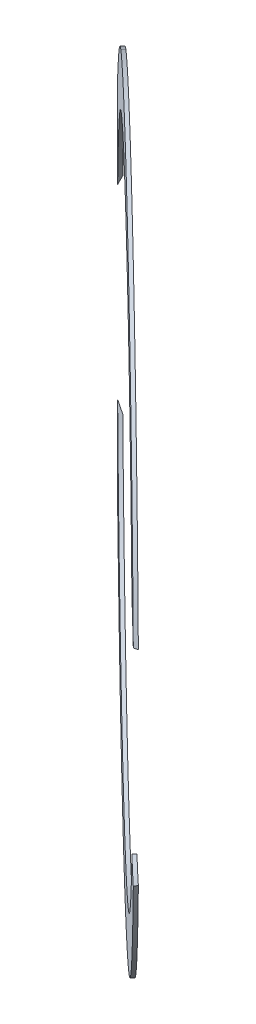
ISO-10303-21;
HEADER;
FILE_DESCRIPTION(('STEP AP214'),'2;1');
FILE_NAME('part.step','',(''),(''),'','','');
FILE_SCHEMA(('AUTOMOTIVE_DESIGN { 1 0 10303 214 1 1 1 1 }'));
ENDSEC;
DATA;
#1=APPLICATION_CONTEXT('core data for automotive mechanical design processes');
#2=APPLICATION_PROTOCOL_DEFINITION('international standard','automotive_design',2000,#1);
#3=PRODUCT_CONTEXT('',#1,'mechanical');
#4=PRODUCT('Part','Part','',(#3));
#5=PRODUCT_RELATED_PRODUCT_CATEGORY('part','',(#4));
#6=PRODUCT_DEFINITION_FORMATION('','',#4);
#7=PRODUCT_DEFINITION_CONTEXT('part definition',#1,'design');
#8=PRODUCT_DEFINITION('design','',#6,#7);
#9=PRODUCT_DEFINITION_SHAPE('','',#8);
#10=(LENGTH_UNIT() NAMED_UNIT(*) SI_UNIT(.MILLI.,.METRE.));
#11=(NAMED_UNIT(*) PLANE_ANGLE_UNIT() SI_UNIT($,.RADIAN.));
#12=(NAMED_UNIT(*) SI_UNIT($,.STERADIAN.) SOLID_ANGLE_UNIT());
#13=UNCERTAINTY_MEASURE_WITH_UNIT(LENGTH_MEASURE(1.E-05),#10,'distance_accuracy_value','');
#14=(GEOMETRIC_REPRESENTATION_CONTEXT(3) GLOBAL_UNCERTAINTY_ASSIGNED_CONTEXT((#13)) GLOBAL_UNIT_ASSIGNED_CONTEXT((#10,
#11,#12)) REPRESENTATION_CONTEXT('',''));
#15=CARTESIAN_POINT('',(0.,0.,0.));
#16=DIRECTION('',(0.,0.,1.));
#17=DIRECTION('',(1.,0.,0.));
#18=AXIS2_PLACEMENT_3D('',#15,#16,#17);
#19=CARTESIAN_POINT('',(-161.990390566707,0.,168.265005002207));
#20=DIRECTION('',(-0.693547097638021,0.,0.720411287639136));
#21=DIRECTION('',(0.720411287639136,0.,0.693547097638021));
#22=AXIS2_PLACEMENT_3D('',#19,#20,#21);
#23=CYLINDRICAL_SURFACE('',#22,298.478991770015);
#24=DIRECTION('',(-0.693547097638021,0.,0.720411287639136));
#25=VECTOR('',#24,1.);
#26=CARTESIAN_POINT('',(-78.6165835414837,265.64566239674,-114.569887943909));
#27=LINE('',#26,#25);
#28=CARTESIAN_POINT('',(-260.035404079115,265.64566239674,73.8760972683337));
#29=VERTEX_POINT('',#28);
#30=CARTESIAN_POINT('',(-262.272648306676,265.64566239674,76.2));
#31=VERTEX_POINT('',#30);
#32=EDGE_CURVE('E96',#29,#31,#27,.T.);
#33=ORIENTED_EDGE('',*,*,#32,.T.);
#34=CARTESIAN_POINT('',(-164.227634794267,0.,170.588907733874));
#35=DIRECTION('',(-0.693547097638021,0.,0.720411287639136));
#36=DIRECTION('',(0.720411287639136,0.,0.693547097638021));
#37=AXIS2_PLACEMENT_3D('',#34,#35,#36);
#38=CIRCLE('',#37,298.478991770015);
#39=CARTESIAN_POINT('',(40.0027643947161,93.3934625162856,367.203540287945));
#40=VERTEX_POINT('',#39);
#41=EDGE_CURVE('E107',#40,#31,#38,.T.);
#42=ORIENTED_EDGE('',*,*,#41,.F.);
#43=CARTESIAN_POINT('',(40.002764394716,93.3934625162856,367.203540287945));
#44=CARTESIAN_POINT('',(40.4197169075131,93.2149037459415,366.855273948581));
#45=CARTESIAN_POINT('',(40.8364476760979,93.0330873220458,366.50848613522));
#46=CARTESIAN_POINT('',(41.6694657248422,92.6629391671512,365.817867560502));
#47=CARTESIAN_POINT('',(42.0857530050017,92.4746074361523,365.474036799145));
#48=CARTESIAN_POINT('',(42.5018185409489,92.2830180516018,365.131684563791));
#49=B_SPLINE_CURVE_WITH_KNOTS('',3,(#43,#44,#45,#46,#47,#48),.UNSPECIFIED.,.F.,.F.,(4,2,4),(0.,
1.71547421922163,3.43094843844166),.UNSPECIFIED.);
#50=CARTESIAN_POINT('',(42.5018185409489,92.2830180516017,365.131684563791));
#51=VERTEX_POINT('',#50);
#52=EDGE_CURVE('E100',#40,#51,#49,.T.);
#53=ORIENTED_EDGE('',*,*,#52,.T.);
#54=CARTESIAN_POINT('',(-161.990390566707,0.,168.265005002207));
#55=DIRECTION('',(-0.693547097638021,0.,0.720411287639136));
#56=DIRECTION('',(0.720411287639136,0.,0.693547097638021));
#57=AXIS2_PLACEMENT_3D('',#54,#55,#56);
#58=CIRCLE('',#57,298.478991770015);
#59=EDGE_CURVE('E109',#51,#29,#58,.T.);
#60=ORIENTED_EDGE('',*,*,#59,.T.);
#61=EDGE_LOOP('',(#33,#42,#53,#60));
#62=FACE_BOUND('',#61,.T.);
#63=ADVANCED_FACE('F41',(#62),#23,.T.);
#64=CARTESIAN_POINT('',(-161.990390566707,0.,168.265005002207));
#65=DIRECTION('',(-0.693547097638021,0.,0.720411287639136));
#66=DIRECTION('',(0.720411287639136,0.,0.693547097638021));
#67=AXIS2_PLACEMENT_3D('',#64,#65,#66);
#68=CYLINDRICAL_SURFACE('',#67,257.203991770015);
#69=CARTESIAN_POINT('',(-164.227634794267,0.,170.588907733874));
#70=DIRECTION('',(-0.693547097638021,0.,0.720411287639136));
#71=DIRECTION('',(0.720411287639136,0.,0.693547097638021));
#72=AXIS2_PLACEMENT_3D('',#69,#70,#71);
#73=CIRCLE('',#72,257.203991770015);
#74=CARTESIAN_POINT('',(6.05168280115659,101.419609224618,334.518497028767));
#75=VERTEX_POINT('',#74);
#76=CARTESIAN_POINT('',(-339.313507627677,84.1866935553801,2.03200000000001));
#77=VERTEX_POINT('',#76);
#78=EDGE_CURVE('E189',#75,#77,#73,.T.);
#79=ORIENTED_EDGE('',*,*,#78,.T.);
#80=CARTESIAN_POINT('',(-1.95622657026756,0.,2.03200000000001));
#81=DIRECTION('',(0.,0.,1.));
#82=DIRECTION('',(-1.,0.,0.));
#83=AXIS2_PLACEMENT_3D('',#80,#81,#82);
#84=ELLIPSE('',#83,357.02382261791,257.203991770015);
#85=CARTESIAN_POINT('',(-334.662345491773,93.2999325440372,2.03200000000001));
#86=VERTEX_POINT('',#85);
#87=EDGE_CURVE('E69',#77,#86,#84,.F.);
#88=ORIENTED_EDGE('',*,*,#87,.T.);
#89=CARTESIAN_POINT('',(-161.990390566707,0.,168.265005002207));
#90=DIRECTION('',(-0.693547097638021,0.,0.720411287639136));
#91=DIRECTION('',(0.720411287639136,0.,0.693547097638021));
#92=AXIS2_PLACEMENT_3D('',#89,#90,#91);
#93=CIRCLE('',#92,257.203991770015);
#94=CARTESIAN_POINT('',(8.33908401654546,101.257195683887,332.242880927157));
#95=VERTEX_POINT('',#94);
#96=EDGE_CURVE('E185',#95,#86,#93,.T.);
#97=ORIENTED_EDGE('',*,*,#96,.F.);
#98=CARTESIAN_POINT('',(6.05168280115659,101.419609224618,334.518497028767));
#99=CARTESIAN_POINT('',(6.43174516079729,101.396947580744,334.137735883871));
#100=CARTESIAN_POINT('',(6.81239310856669,101.372082297079,333.757720636288));
#101=CARTESIAN_POINT('',(7.57486018036299,101.317944450169,332.999181935751));
#102=CARTESIAN_POINT('',(7.95667930438988,101.288671886923,332.620658482797));
#103=CARTESIAN_POINT('',(8.33908401654547,101.257195683887,332.242880927157));
#104=B_SPLINE_CURVE_WITH_KNOTS('',3,(#98,#99,#100,#101,#102,#103),.UNSPECIFIED.,.F.,.F.,(4,2,4),
(0.,1.61533420003762,3.2306684000757),.UNSPECIFIED.);
#105=EDGE_CURVE('E115',#75,#95,#104,.T.);
#106=ORIENTED_EDGE('',*,*,#105,.F.);
#107=EDGE_LOOP('',(#79,#88,#97,#106));
#108=FACE_BOUND('',#107,.T.);
#109=ADVANCED_FACE('F142',(#108),#68,.F.);
#110=CARTESIAN_POINT('',(-161.990390566707,0.,168.265005002207));
#111=DIRECTION('',(-0.693547097638021,0.,0.720411287639136));
#112=DIRECTION('',(0.720411287639136,0.,0.693547097638021));
#113=AXIS2_PLACEMENT_3D('',#110,#111,#112);
#114=PLANE('',#113);
#115=DIRECTION('',(0.,1.,0.));
#116=VECTOR('',#115,1.);
#117=CARTESIAN_POINT('',(-334.662345491773,0.,2.03200000000001));
#118=LINE('',#117,#116);
#119=CARTESIAN_POINT('',(-334.662345491773,173.506415254575,2.03200000000001));
#120=VERTEX_POINT('',#119);
#121=EDGE_CURVE('E119',#86,#120,#118,.T.);
#122=ORIENTED_EDGE('',*,*,#121,.T.);
#123=CARTESIAN_POINT('',(-337.076263400116,168.762219099896,-0.291902731666349));
#124=CARTESIAN_POINT('',(-332.060183368177,178.813727079636,4.53712730626155));
#125=CARTESIAN_POINT('',(-326.676500962699,188.365480078971,9.72005179813079));
#126=CARTESIAN_POINT('',(-315.22164244929,206.53433922405,20.7477577934989));
#127=CARTESIAN_POINT('',(-309.150955964705,215.15211101214,26.5920679317423));
#128=CARTESIAN_POINT('',(-299.530478500676,227.379377620367,35.8537970822321));
#129=CARTESIAN_POINT('',(-296.237546670195,231.338072141588,39.0239352421074));
#130=CARTESIAN_POINT('',(-289.47228851309,239.011574584378,45.5369164240221));
#131=CARTESIAN_POINT('',(-286.000214208807,242.726725130017,48.8795168216507));
#132=CARTESIAN_POINT('',(-278.859787579345,249.890186490247,55.7536764159422));
#133=CARTESIAN_POINT('',(-275.2161116445,253.315093679198,59.2614794066848));
#134=CARTESIAN_POINT('',(-269.628302330082,258.173655161568,64.6409189000192));
#135=CARTESIAN_POINT('',(-267.744906528284,259.746699718029,66.4540827335856));
#136=CARTESIAN_POINT('',(-263.929689162367,262.784547330973,70.1270303627952));
#137=CARTESIAN_POINT('',(-261.998106643118,264.249884701716,71.9865840275682));
#138=CARTESIAN_POINT('',(-260.035404079115,265.64566239674,73.8760972683337));
#139=B_SPLINE_CURVE_WITH_KNOTS('',3,(#123,#124,#125,#126,#127,#128,#129,#130,#131,#132,#133,
#134,#135,#136,#137,#138),.UNSPECIFIED.,.F.,.F.,(4,2,2,2,2,2,2,4),(0.,0.25,0.500000000000001,
0.625000000000001,0.75,0.875,0.9375,1.),.UNSPECIFIED.);
#140=EDGE_CURVE('E62',#120,#29,#139,.T.);
#141=ORIENTED_EDGE('',*,*,#140,.T.);
#142=ORIENTED_EDGE('',*,*,#59,.F.);
#143=CARTESIAN_POINT('',(0.,0.,324.214761968072));
#144=DIRECTION('',(-0.693547097638021,0.,0.720411287639136));
#145=DIRECTION('',(-0.720411287639136,0.,-0.693547097638021));
#146=AXIS2_PLACEMENT_3D('',#143,#144,#145);
#147=ELLIPSE('',#146,141.030549830714,101.6);
#148=EDGE_CURVE('E117',#95,#51,#147,.F.);
#149=ORIENTED_EDGE('',*,*,#148,.F.);
#150=ORIENTED_EDGE('',*,*,#96,.T.);
#151=EDGE_LOOP('',(#122,#141,#142,#149,#150));
#152=FACE_BOUND('',#151,.T.);
#153=ADVANCED_FACE('F141',(#152),#114,.F.);
#154=CARTESIAN_POINT('',(-164.227634794267,0.,170.588907733874));
#155=DIRECTION('',(-0.693547097638021,0.,0.720411287639136));
#156=DIRECTION('',(0.720411287639136,0.,0.693547097638021));
#157=AXIS2_PLACEMENT_3D('',#154,#155,#156);
#158=PLANE('',#157);
#159=CARTESIAN_POINT('',(-339.313507627677,168.762219099896,2.03199999999995));
#160=CARTESIAN_POINT('',(-334.297427595738,178.813727079636,6.86103003792785));
#161=CARTESIAN_POINT('',(-328.91374519026,188.365480078971,12.0439545297971));
#162=CARTESIAN_POINT('',(-317.458886676851,206.53433922405,23.0716605251652));
#163=CARTESIAN_POINT('',(-311.388200192266,215.15211101214,28.9159706634086));
#164=CARTESIAN_POINT('',(-301.767722728237,227.379377620367,38.1776998138984));
#165=CARTESIAN_POINT('',(-298.474790897756,231.338072141588,41.3478379737737));
#166=CARTESIAN_POINT('',(-291.709532740651,239.011574584378,47.8608191556883));
#167=CARTESIAN_POINT('',(-288.237458436368,242.726725130017,51.203419553317));
#168=CARTESIAN_POINT('',(-281.097031806906,249.890186490247,58.0775791476085));
#169=CARTESIAN_POINT('',(-277.453355872061,253.315093679198,61.5853821383511));
#170=CARTESIAN_POINT('',(-271.865546557642,258.173655161568,66.9648216316855));
#171=CARTESIAN_POINT('',(-269.982150755845,259.746699718029,68.7779854652519));
#172=CARTESIAN_POINT('',(-266.166933389928,262.784547330973,72.4509330944615));
#173=CARTESIAN_POINT('',(-264.235350870679,264.249884701716,74.3104867592345));
#174=CARTESIAN_POINT('',(-262.272648306676,265.64566239674,76.2));
#175=B_SPLINE_CURVE_WITH_KNOTS('',3,(#159,#160,#161,#162,#163,#164,#165,#166,#167,#168,#169,
#170,#171,#172,#173,#174),.UNSPECIFIED.,.F.,.F.,(4,2,2,2,2,2,2,4),(0.,0.25,0.500000000000001,
0.625000000000001,0.75,0.875,0.9375,1.),.UNSPECIFIED.);
#176=CARTESIAN_POINT('',(-339.313507627677,168.762219099896,2.03199999999998));
#177=VERTEX_POINT('',#176);
#178=EDGE_CURVE('E92',#177,#31,#175,.T.);
#179=ORIENTED_EDGE('',*,*,#178,.F.);
#180=DIRECTION('',(0.,1.,0.));
#181=VECTOR('',#180,1.);
#182=CARTESIAN_POINT('',(-339.313507627677,0.,2.03200000000001));
#183=LINE('',#182,#181);
#184=EDGE_CURVE('E55',#77,#177,#183,.T.);
#185=ORIENTED_EDGE('',*,*,#184,.F.);
#186=ORIENTED_EDGE('',*,*,#78,.F.);
#187=CARTESIAN_POINT('',(0.,0.,328.692481925197));
#188=DIRECTION('',(-0.693547097638021,0.,0.720411287639136));
#189=DIRECTION('',(-0.720411287639136,0.,-0.693547097638021));
#190=AXIS2_PLACEMENT_3D('',#187,#188,#189);
#191=ELLIPSE('',#190,141.030549830714,101.6);
#192=EDGE_CURVE('E114',#75,#40,#191,.F.);
#193=ORIENTED_EDGE('',*,*,#192,.T.);
#194=ORIENTED_EDGE('',*,*,#41,.T.);
#195=EDGE_LOOP('',(#179,#185,#186,#193,#194));
#196=FACE_BOUND('',#195,.T.);
#197=ADVANCED_FACE('F112',(#196),#158,.T.);
#198=CARTESIAN_POINT('',(0.,0.,377.59814618189));
#199=DIRECTION('',(0.,0.,-1.));
#200=DIRECTION('',(-1.,0.,0.));
#201=AXIS2_PLACEMENT_3D('',#198,#199,#200);
#202=CYLINDRICAL_SURFACE('',#201,101.6);
#203=ORIENTED_EDGE('',*,*,#192,.F.);
#204=ORIENTED_EDGE('',*,*,#105,.T.);
#205=ORIENTED_EDGE('',*,*,#148,.T.);
#206=ORIENTED_EDGE('',*,*,#52,.F.);
#207=EDGE_LOOP('',(#203,#204,#205,#206));
#208=FACE_BOUND('',#207,.T.);
#209=ADVANCED_FACE('F140',(#208),#202,.F.);
#210=CARTESIAN_POINT('',(0.,0.,2.032));
#211=DIRECTION('',(0.,0.,1.));
#212=DIRECTION('',(1.,0.,0.));
#213=AXIS2_PLACEMENT_3D('',#210,#211,#212);
#214=PLANE('',#213);
#215=ORIENTED_EDGE('',*,*,#184,.T.);
#216=CARTESIAN_POINT('',(-339.313507627677,168.762219099896,2.032));
#217=CARTESIAN_POINT('',(-338.545956446974,169.560411097493,2.032));
#218=CARTESIAN_POINT('',(-337.774584011963,170.354856775849,2.032));
#219=CARTESIAN_POINT('',(-336.224196633329,171.936255494075,2.032));
#220=CARTESIAN_POINT('',(-335.445181689704,172.723208533946,2.03200000000001));
#221=CARTESIAN_POINT('',(-334.662345491773,173.506415254575,2.03200000000001));
#222=B_SPLINE_CURVE_WITH_KNOTS('',3,(#216,#217,#218,#219,#220,#221),.UNSPECIFIED.,.F.,.F.,(4,2,
4),(0.,3.32196242064323,6.64392484128651),.UNSPECIFIED.);
#223=EDGE_CURVE('E12',#177,#120,#222,.T.);
#224=ORIENTED_EDGE('',*,*,#223,.T.);
#225=ORIENTED_EDGE('',*,*,#121,.F.);
#226=ORIENTED_EDGE('',*,*,#87,.F.);
#227=EDGE_LOOP('',(#215,#224,#225,#226));
#228=FACE_BOUND('',#227,.T.);
#229=ADVANCED_FACE('F43',(#228),#214,.F.);
#230=CARTESIAN_POINT('',(-155.657442862485,168.762219099896,-188.737887943909));
#231=CARTESIAN_POINT('',(-150.641362830545,178.813727079636,-183.908857905981));
#232=CARTESIAN_POINT('',(-145.257680425068,188.365480078971,-178.725933414112));
#233=CARTESIAN_POINT('',(-133.802821911659,206.53433922405,-167.698227418744));
#234=CARTESIAN_POINT('',(-127.732135427074,215.15211101214,-161.853917280501));
#235=CARTESIAN_POINT('',(-118.111657963045,227.379377620367,-152.592188130011));
#236=CARTESIAN_POINT('',(-114.818726132564,231.338072141588,-149.422049970136));
#237=CARTESIAN_POINT('',(-108.053467975458,239.011574584378,-142.909068788221));
#238=CARTESIAN_POINT('',(-104.581393671176,242.726725130017,-139.566468390592));
#239=CARTESIAN_POINT('',(-97.4409670417138,249.890186490247,-132.692308796301));
#240=CARTESIAN_POINT('',(-93.7972911068689,253.315093679198,-129.184505805558));
#241=CARTESIAN_POINT('',(-88.2094817924501,258.173655161568,-123.805066312224));
#242=CARTESIAN_POINT('',(-86.3260859906525,259.746699718029,-121.991902478657));
#243=CARTESIAN_POINT('',(-82.5108686247353,262.784547330973,-118.318954849448));
#244=CARTESIAN_POINT('',(-80.5792861054868,264.249884701716,-116.459401184675));
#245=CARTESIAN_POINT('',(-78.6165835414837,265.64566239674,-114.569887943909));
#246=B_SPLINE_CURVE_WITH_KNOTS('',3,(#230,#231,#232,#233,#234,#235,#236,#237,#238,#239,#240,
#241,#242,#243,#244,#245),.UNSPECIFIED.,.F.,.F.,(4,2,2,2,2,2,2,4),(0.,0.25,0.500000000000001,
0.625000000000001,0.75,0.875,0.9375,1.),.UNSPECIFIED.);
#247=DIRECTION('',(-0.693547097638021,0.,0.720411287639136));
#248=VECTOR('',#247,1.);
#249=SURFACE_OF_LINEAR_EXTRUSION('',#246,#248);
#250=ORIENTED_EDGE('',*,*,#223,.F.);
#251=ORIENTED_EDGE('',*,*,#178,.T.);
#252=ORIENTED_EDGE('',*,*,#32,.F.);
#253=ORIENTED_EDGE('',*,*,#140,.F.);
#254=EDGE_LOOP('',(#250,#251,#252,#253));
#255=FACE_BOUND('',#254,.T.);
#256=ADVANCED_FACE('F95',(#255),#249,.F.);
#257=CLOSED_SHELL('',(#63,#109,#153,#197,#209,#229,#256));
#258=MANIFOLD_SOLID_BREP('B2',#257);
#259=CARTESIAN_POINT('',(0.,0.,377.59814618189));
#260=DIRECTION('',(0.,0.,-1.));
#261=DIRECTION('',(-1.,0.,0.));
#262=AXIS2_PLACEMENT_3D('',#259,#260,#261);
#263=CYLINDRICAL_SURFACE('',#262,101.6);
#264=CARTESIAN_POINT('',(0.,0.,324.214761968072));
#265=DIRECTION('',(-0.693547097638021,0.,0.720411287639136));
#266=DIRECTION('',(-0.720411287639136,0.,-0.693547097638021));
#267=AXIS2_PLACEMENT_3D('',#264,#265,#266);
#268=ELLIPSE('',#267,141.030549830714,101.6);
#269=CARTESIAN_POINT('',(42.5018185409489,-92.2830180516017,365.131684563791));
#270=VERTEX_POINT('',#269);
#271=CARTESIAN_POINT('',(8.33908401654548,-101.257195683887,332.242880927157));
#272=VERTEX_POINT('',#271);
#273=EDGE_CURVE('E337',#270,#272,#268,.F.);
#274=ORIENTED_EDGE('',*,*,#273,.T.);
#275=CARTESIAN_POINT('',(8.33908401654546,-101.257195683887,332.242880927157));
#276=CARTESIAN_POINT('',(7.95667930438987,-101.288671886923,332.620658482797));
#277=CARTESIAN_POINT('',(7.57486018036297,-101.317944450169,332.999181935751));
#278=CARTESIAN_POINT('',(6.81239310856668,-101.372082297079,333.757720636288));
#279=CARTESIAN_POINT('',(6.43174516079728,-101.396947580744,334.137735883871));
#280=CARTESIAN_POINT('',(6.05168280115658,-101.419609224618,334.518497028767));
#281=B_SPLINE_CURVE_WITH_KNOTS('',3,(#275,#276,#277,#278,#279,#280),.UNSPECIFIED.,.F.,.F.,(4,2,
4),(0.,1.61533420003808,3.2306684000757),.UNSPECIFIED.);
#282=CARTESIAN_POINT('',(6.05168280115659,-101.419609224618,334.518497028767));
#283=VERTEX_POINT('',#282);
#284=EDGE_CURVE('E321',#272,#283,#281,.T.);
#285=ORIENTED_EDGE('',*,*,#284,.T.);
#286=CARTESIAN_POINT('',(0.,0.,328.692481925197));
#287=DIRECTION('',(-0.693547097638021,0.,0.720411287639136));
#288=DIRECTION('',(-0.720411287639136,0.,-0.693547097638021));
#289=AXIS2_PLACEMENT_3D('',#286,#287,#288);
#290=ELLIPSE('',#289,141.030549830714,101.6);
#291=CARTESIAN_POINT('',(40.0027643947161,-93.3934625162856,367.203540287945));
#292=VERTEX_POINT('',#291);
#293=EDGE_CURVE('E333',#292,#283,#290,.F.);
#294=ORIENTED_EDGE('',*,*,#293,.F.);
#295=CARTESIAN_POINT('',(42.5018185409489,-92.2830180516017,365.131684563791));
#296=CARTESIAN_POINT('',(42.0857530050018,-92.4746074361523,365.474036799145));
#297=CARTESIAN_POINT('',(41.6694657248422,-92.6629391671512,365.817867560502));
#298=CARTESIAN_POINT('',(40.8364476760979,-93.0330873220458,366.50848613522));
#299=CARTESIAN_POINT('',(40.4197169075131,-93.2149037459416,366.855273948581));
#300=CARTESIAN_POINT('',(40.002764394716,-93.3934625162856,367.203540287945));
#301=B_SPLINE_CURVE_WITH_KNOTS('',3,(#295,#296,#297,#298,#299,#300),.UNSPECIFIED.,.F.,.F.,(4,2,
4),(0.,1.71547421922004,3.43094843844168),.UNSPECIFIED.);
#302=EDGE_CURVE('E317',#270,#292,#301,.T.);
#303=ORIENTED_EDGE('',*,*,#302,.F.);
#304=EDGE_LOOP('',(#274,#285,#294,#303));
#305=FACE_BOUND('',#304,.T.);
#306=ADVANCED_FACE('F245',(#305),#263,.F.);
#307=CARTESIAN_POINT('',(-161.990390566707,0.,168.265005002207));
#308=DIRECTION('',(-0.693547097638021,0.,0.720411287639136));
#309=DIRECTION('',(0.720411287639136,0.,0.693547097638021));
#310=AXIS2_PLACEMENT_3D('',#307,#308,#309);
#311=CYLINDRICAL_SURFACE('',#310,257.203991770015);
#312=CARTESIAN_POINT('',(-161.990390566707,0.,168.265005002207));
#313=DIRECTION('',(-0.693547097638021,0.,0.720411287639136));
#314=DIRECTION('',(0.720411287639136,0.,0.693547097638021));
#315=AXIS2_PLACEMENT_3D('',#312,#313,#314);
#316=CIRCLE('',#315,257.203991770015);
#317=CARTESIAN_POINT('',(-334.662345491773,-93.2999325440372,2.03200000000001));
#318=VERTEX_POINT('',#317);
#319=EDGE_CURVE('E319',#318,#272,#316,.T.);
#320=ORIENTED_EDGE('',*,*,#319,.F.);
#321=CARTESIAN_POINT('',(-1.95622657026756,0.,2.03200000000001));
#322=DIRECTION('',(0.,0.,1.));
#323=DIRECTION('',(-1.,0.,0.));
#324=AXIS2_PLACEMENT_3D('',#321,#322,#323);
#325=ELLIPSE('',#324,357.02382261791,257.203991770015);
#326=CARTESIAN_POINT('',(-339.313507627677,-84.1866935553801,2.03200000000001));
#327=VERTEX_POINT('',#326);
#328=EDGE_CURVE('E260',#318,#327,#325,.F.);
#329=ORIENTED_EDGE('',*,*,#328,.T.);
#330=CARTESIAN_POINT('',(-164.227634794267,0.,170.588907733874));
#331=DIRECTION('',(-0.693547097638021,0.,0.720411287639136));
#332=DIRECTION('',(0.720411287639136,0.,0.693547097638021));
#333=AXIS2_PLACEMENT_3D('',#330,#331,#332);
#334=CIRCLE('',#333,257.203991770015);
#335=EDGE_CURVE('E323',#327,#283,#334,.T.);
#336=ORIENTED_EDGE('',*,*,#335,.T.);
#337=ORIENTED_EDGE('',*,*,#284,.F.);
#338=EDGE_LOOP('',(#320,#329,#336,#337));
#339=FACE_BOUND('',#338,.T.);
#340=ADVANCED_FACE('F353',(#339),#311,.F.);
#341=CARTESIAN_POINT('',(-164.227634794267,0.,170.588907733874));
#342=DIRECTION('',(-0.693547097638021,0.,0.720411287639136));
#343=DIRECTION('',(0.720411287639136,0.,0.693547097638021));
#344=AXIS2_PLACEMENT_3D('',#341,#342,#343);
#345=PLANE('',#344);
#346=CARTESIAN_POINT('',(-262.272648306676,-265.64566239674,76.1999999999999));
#347=CARTESIAN_POINT('',(-264.230509782433,-264.25332744598,74.3151473229434));
#348=CARTESIAN_POINT('',(-266.158694935596,-262.790832152815,72.458864336224));
#349=CARTESIAN_POINT('',(-269.969161258609,-259.757316017976,68.7904905831786));
#350=CARTESIAN_POINT('',(-271.851218712123,-258.185766269304,66.9786151907899));
#351=CARTESIAN_POINT('',(-275.575415810753,-254.948293653579,63.3932936763925));
#352=CARTESIAN_POINT('',(-277.419429469692,-253.280304754892,61.618043422676));
#353=CARTESIAN_POINT('',(-281.056767935799,-249.871314445755,58.1163415759946));
#354=CARTESIAN_POINT('',(-282.851079768595,-248.129506052597,56.3889397636613));
#355=CARTESIAN_POINT('',(-288.166172750444,-242.80015254008,51.2720469907595));
#356=CARTESIAN_POINT('',(-291.619438534426,-239.109180252853,47.9475537423235));
#357=CARTESIAN_POINT('',(-298.359900673367,-231.472832985096,41.4584439332293));
#358=CARTESIAN_POINT('',(-301.646880757967,-227.527126698785,38.2940355781924));
#359=CARTESIAN_POINT('',(-311.265718039748,-215.319128933962,29.0338854474339));
#360=CARTESIAN_POINT('',(-317.356910002889,-206.688161028464,23.1698344814404));
#361=CARTESIAN_POINT('',(-324.560964132489,-195.271468149337,16.2344200611801));
#362=CARTESIAN_POINT('',(-325.981148608384,-192.956531951781,14.8671943690405));
#363=CARTESIAN_POINT('',(-328.779576604946,-188.262409971226,12.1731199586777));
#364=CARTESIAN_POINT('',(-330.156442594608,-185.885421736105,10.8475974032279));
#365=CARTESIAN_POINT('',(-334.20942983145,-178.681435362112,6.94574635910081));
#366=CARTESIAN_POINT('',(-336.812054558709,-173.774773788733,4.44017369970146));
#367=CARTESIAN_POINT('',(-339.313507627677,-168.762219099896,2.03200000000001));
#368=B_SPLINE_CURVE_WITH_KNOTS('',3,(#346,#347,#348,#349,#350,#351,#352,#353,#354,#355,#356,
#357,#358,#359,#360,#361,#362,#363,#364,#365,#366,#367),.UNSPECIFIED.,.F.,.F.,(4,2,2,2,2,2,2,2,
2,2,4),(0.,0.0625000000000001,0.125,0.1875,0.25,0.375,0.5,0.75,0.8125,0.875,1.),.UNSPECIFIED.);
#369=CARTESIAN_POINT('',(-262.272648306676,-265.64566239674,76.1999999999999));
#370=VERTEX_POINT('',#369);
#371=CARTESIAN_POINT('',(-339.313507627677,-168.762219099896,2.032));
#372=VERTEX_POINT('',#371);
#373=EDGE_CURVE('E267',#370,#372,#368,.T.);
#374=ORIENTED_EDGE('',*,*,#373,.F.);
#375=CARTESIAN_POINT('',(-164.227634794267,0.,170.588907733874));
#376=DIRECTION('',(-0.693547097638021,0.,0.720411287639136));
#377=DIRECTION('',(0.720411287639136,0.,0.693547097638021));
#378=AXIS2_PLACEMENT_3D('',#375,#376,#377);
#379=CIRCLE('',#378,298.478991770015);
#380=EDGE_CURVE('E310',#370,#292,#379,.T.);
#381=ORIENTED_EDGE('',*,*,#380,.T.);
#382=ORIENTED_EDGE('',*,*,#293,.T.);
#383=ORIENTED_EDGE('',*,*,#335,.F.);
#384=DIRECTION('',(0.,1.,0.));
#385=VECTOR('',#384,1.);
#386=CARTESIAN_POINT('',(-339.313507627677,0.,2.03200000000001));
#387=LINE('',#386,#385);
#388=EDGE_CURVE('E274',#372,#327,#387,.T.);
#389=ORIENTED_EDGE('',*,*,#388,.F.);
#390=EDGE_LOOP('',(#374,#381,#382,#383,#389));
#391=FACE_BOUND('',#390,.T.);
#392=ADVANCED_FACE('F308',(#391),#345,.T.);
#393=CARTESIAN_POINT('',(-161.990390566707,0.,168.265005002207));
#394=DIRECTION('',(-0.693547097638021,0.,0.720411287639136));
#395=DIRECTION('',(0.720411287639136,0.,0.693547097638021));
#396=AXIS2_PLACEMENT_3D('',#393,#394,#395);
#397=PLANE('',#396);
#398=CARTESIAN_POINT('',(-161.990390566707,0.,168.265005002207));
#399=DIRECTION('',(-0.693547097638021,0.,0.720411287639136));
#400=DIRECTION('',(0.720411287639136,0.,0.693547097638021));
#401=AXIS2_PLACEMENT_3D('',#398,#399,#400);
#402=CIRCLE('',#401,298.478991770015);
#403=CARTESIAN_POINT('',(-260.035404079115,-265.64566239674,73.8760972683336));
#404=VERTEX_POINT('',#403);
#405=EDGE_CURVE('E318',#404,#270,#402,.T.);
#406=ORIENTED_EDGE('',*,*,#405,.F.);
#407=CARTESIAN_POINT('',(-260.035404079115,-265.64566239674,73.8760972683336));
#408=CARTESIAN_POINT('',(-261.993265554872,-264.25332744598,71.9912445912772));
#409=CARTESIAN_POINT('',(-263.921450708035,-262.790832152815,70.1349616045577));
#410=CARTESIAN_POINT('',(-267.731917031048,-259.757316017976,66.4665878515123));
#411=CARTESIAN_POINT('',(-269.613974484562,-258.185766269304,64.6547124591236));
#412=CARTESIAN_POINT('',(-273.338171583193,-254.948293653579,61.0693909447262));
#413=CARTESIAN_POINT('',(-275.182185242131,-253.280304754892,59.2941406910097));
#414=CARTESIAN_POINT('',(-278.819523708239,-249.871314445755,55.7924388443283));
#415=CARTESIAN_POINT('',(-280.613835541035,-248.129506052597,54.065037031995));
#416=CARTESIAN_POINT('',(-285.928928522884,-242.80015254008,48.9481442590932));
#417=CARTESIAN_POINT('',(-289.382194306866,-239.109180252853,45.6236510106572));
#418=CARTESIAN_POINT('',(-296.122656445807,-231.472832985096,39.134541201563));
#419=CARTESIAN_POINT('',(-299.409636530406,-227.527126698785,35.9701328465261));
#420=CARTESIAN_POINT('',(-309.028473812187,-215.319128933962,26.7099827157676));
#421=CARTESIAN_POINT('',(-315.119665775329,-206.688161028464,20.8459317497741));
#422=CARTESIAN_POINT('',(-322.323719904928,-195.271468149337,13.9105173295138));
#423=CARTESIAN_POINT('',(-323.743904380823,-192.956531951781,12.5432916373742));
#424=CARTESIAN_POINT('',(-326.542332377386,-188.262409971226,9.8492172270114));
#425=CARTESIAN_POINT('',(-327.919198367047,-185.885421736105,8.52369467156158));
#426=CARTESIAN_POINT('',(-331.972185603889,-178.681435362112,4.62184362743451));
#427=CARTESIAN_POINT('',(-334.574810331148,-173.774773788733,2.11627096803516));
#428=CARTESIAN_POINT('',(-337.076263400116,-168.762219099896,-0.291902731666294));
#429=B_SPLINE_CURVE_WITH_KNOTS('',3,(#407,#408,#409,#410,#411,#412,#413,#414,#415,#416,#417,
#418,#419,#420,#421,#422,#423,#424,#425,#426,#427,#428),.UNSPECIFIED.,.F.,.F.,(4,2,2,2,2,2,2,2,
2,2,4),(0.,0.0625000000000001,0.125,0.1875,0.25,0.375,0.5,0.75,0.8125,0.875,1.),.UNSPECIFIED.);
#430=CARTESIAN_POINT('',(-334.662345491773,-173.506150768829,2.03200000000003));
#431=VERTEX_POINT('',#430);
#432=EDGE_CURVE('E301',#404,#431,#429,.T.);
#433=ORIENTED_EDGE('',*,*,#432,.T.);
#434=DIRECTION('',(0.,1.,0.));
#435=VECTOR('',#434,1.);
#436=CARTESIAN_POINT('',(-334.662345491773,0.,2.03200000000001));
#437=LINE('',#436,#435);
#438=EDGE_CURVE('E331',#431,#318,#437,.T.);
#439=ORIENTED_EDGE('',*,*,#438,.T.);
#440=ORIENTED_EDGE('',*,*,#319,.T.);
#441=ORIENTED_EDGE('',*,*,#273,.F.);
#442=EDGE_LOOP('',(#406,#433,#439,#440,#441));
#443=FACE_BOUND('',#442,.T.);
#444=ADVANCED_FACE('F369',(#443),#397,.F.);
#445=CARTESIAN_POINT('',(-161.990390566707,0.,168.265005002207));
#446=DIRECTION('',(-0.693547097638021,0.,0.720411287639136));
#447=DIRECTION('',(0.720411287639136,0.,0.693547097638021));
#448=AXIS2_PLACEMENT_3D('',#445,#446,#447);
#449=CYLINDRICAL_SURFACE('',#448,298.478991770015);
#450=DIRECTION('',(-0.693547097638021,0.,0.720411287639136));
#451=VECTOR('',#450,1.);
#452=CARTESIAN_POINT('',(-78.6165835414838,-265.64566239674,-114.569887943909));
#453=LINE('',#452,#451);
#454=EDGE_CURVE('E298',#404,#370,#453,.T.);
#455=ORIENTED_EDGE('',*,*,#454,.F.);
#456=ORIENTED_EDGE('',*,*,#405,.T.);
#457=ORIENTED_EDGE('',*,*,#302,.T.);
#458=ORIENTED_EDGE('',*,*,#380,.F.);
#459=EDGE_LOOP('',(#455,#456,#457,#458));
#460=FACE_BOUND('',#459,.T.);
#461=ADVANCED_FACE('F247',(#460),#449,.T.);
#462=CARTESIAN_POINT('',(0.,0.,2.032));
#463=DIRECTION('',(0.,0.,1.));
#464=DIRECTION('',(1.,0.,0.));
#465=AXIS2_PLACEMENT_3D('',#462,#463,#464);
#466=PLANE('',#465);
#467=ORIENTED_EDGE('',*,*,#438,.F.);
#468=CARTESIAN_POINT('',(-334.662345491773,-173.506150768829,2.03200000000003));
#469=CARTESIAN_POINT('',(-334.923283996781,-173.245096993738,2.03200000000001));
#470=CARTESIAN_POINT('',(-335.183805644673,-172.983626523577,2.032));
#471=CARTESIAN_POINT('',(-335.704003984836,-172.459857210716,2.032));
#472=CARTESIAN_POINT('',(-335.963680694565,-172.197558385357,2.032));
#473=CARTESIAN_POINT('',(-336.482186053393,-171.672129275326,2.032));
#474=CARTESIAN_POINT('',(-336.741014711354,-171.408998999399,2.032));
#475=CARTESIAN_POINT('',(-337.257820879714,-170.881903855907,2.032));
#476=CARTESIAN_POINT('',(-337.515798390025,-170.617938988255,2.032));
#477=CARTESIAN_POINT('',(-338.030899049526,-170.089171616266,2.032));
#478=CARTESIAN_POINT('',(-338.28802218982,-169.824369103262,2.03199999999999));
#479=CARTESIAN_POINT('',(-338.801410914574,-169.293923351253,2.03200000000001));
#480=CARTESIAN_POINT('',(-339.057676480975,-169.02828009477,2.03200000000002));
#481=CARTESIAN_POINT('',(-339.313507627677,-168.762219099896,2.03200000000007));
#482=B_SPLINE_CURVE_WITH_KNOTS('',3,(#468,#469,#470,#471,#472,#473,#474,#475,#476,#477,#478,
#479,#480,#481),.UNSPECIFIED.,.F.,.F.,(4,2,2,2,2,2,4),(0.,1.10731242221804,2.21460181558864,
3.32187960190649,4.42915750253076,5.53644689590171,6.64375946099864),.UNSPECIFIED.);
#483=EDGE_CURVE('E39',#431,#372,#482,.T.);
#484=ORIENTED_EDGE('',*,*,#483,.T.);
#485=ORIENTED_EDGE('',*,*,#388,.T.);
#486=ORIENTED_EDGE('',*,*,#328,.F.);
#487=EDGE_LOOP('',(#467,#484,#485,#486));
#488=FACE_BOUND('',#487,.T.);
#489=ADVANCED_FACE('F355',(#488),#466,.F.);
#490=CARTESIAN_POINT('',(-78.6165835414838,-265.64566239674,-114.569887943909));
#491=CARTESIAN_POINT('',(-80.5744450172404,-264.25332744598,-116.454740620966));
#492=CARTESIAN_POINT('',(-82.5026301704038,-262.790832152815,-118.311023607685));
#493=CARTESIAN_POINT('',(-86.3130964934168,-259.757316017976,-121.979397360731));
#494=CARTESIAN_POINT('',(-88.1951539469304,-258.185766269304,-123.791272753119));
#495=CARTESIAN_POINT('',(-91.9193510455613,-254.948293653579,-127.376594267517));
#496=CARTESIAN_POINT('',(-93.7633647044997,-253.280304754892,-129.151844521233));
#497=CARTESIAN_POINT('',(-97.4007031706073,-249.871314445755,-132.653546367915));
#498=CARTESIAN_POINT('',(-99.1950150034033,-248.129506052597,-134.380948180248));
#499=CARTESIAN_POINT('',(-104.510107985252,-242.80015254008,-139.49784095315));
#500=CARTESIAN_POINT('',(-107.963373769234,-239.109180252853,-142.822334201586));
#501=CARTESIAN_POINT('',(-114.703835908175,-231.472832985096,-149.31144401068));
#502=CARTESIAN_POINT('',(-117.990815992775,-227.527126698785,-152.475852365717));
#503=CARTESIAN_POINT('',(-127.609653274556,-215.319128933962,-161.736002496475));
#504=CARTESIAN_POINT('',(-133.700845237697,-206.688161028464,-167.600053462469));
#505=CARTESIAN_POINT('',(-140.904899367296,-195.271468149337,-174.535467882729));
#506=CARTESIAN_POINT('',(-142.325083843191,-192.956531951781,-175.902693574869));
#507=CARTESIAN_POINT('',(-145.123511839754,-188.262409971226,-178.596767985232));
#508=CARTESIAN_POINT('',(-146.500377829416,-185.885421736105,-179.922290540681));
#509=CARTESIAN_POINT('',(-150.553365066258,-178.681435362112,-183.824141584808));
#510=CARTESIAN_POINT('',(-153.155989793517,-173.774773788733,-186.329714244208));
#511=CARTESIAN_POINT('',(-155.657442862485,-168.762219099896,-188.737887943909));
#512=B_SPLINE_CURVE_WITH_KNOTS('',3,(#490,#491,#492,#493,#494,#495,#496,#497,#498,#499,#500,
#501,#502,#503,#504,#505,#506,#507,#508,#509,#510,#511),.UNSPECIFIED.,.F.,.F.,(4,2,2,2,2,2,2,2,
2,2,4),(0.,0.0625000000000001,0.125,0.1875,0.25,0.375,0.5,0.75,0.8125,0.875,1.),.UNSPECIFIED.);
#513=DIRECTION('',(-0.693547097638021,0.,0.720411287639136));
#514=VECTOR('',#513,1.);
#515=SURFACE_OF_LINEAR_EXTRUSION('',#512,#514);
#516=ORIENTED_EDGE('',*,*,#454,.T.);
#517=ORIENTED_EDGE('',*,*,#373,.T.);
#518=ORIENTED_EDGE('',*,*,#483,.F.);
#519=ORIENTED_EDGE('',*,*,#432,.F.);
#520=EDGE_LOOP('',(#516,#517,#518,#519));
#521=FACE_BOUND('',#520,.T.);
#522=ADVANCED_FACE('F299',(#521),#515,.F.);
#523=CLOSED_SHELL('',(#306,#340,#392,#444,#461,#489,#522));
#524=MANIFOLD_SOLID_BREP('B6',#523);
#525=ADVANCED_BREP_SHAPE_REPRESENTATION('',(#18,#258,#524),#14);
#526=SHAPE_DEFINITION_REPRESENTATION(#9,#525);
ENDSEC;
END-ISO-10303-21;
